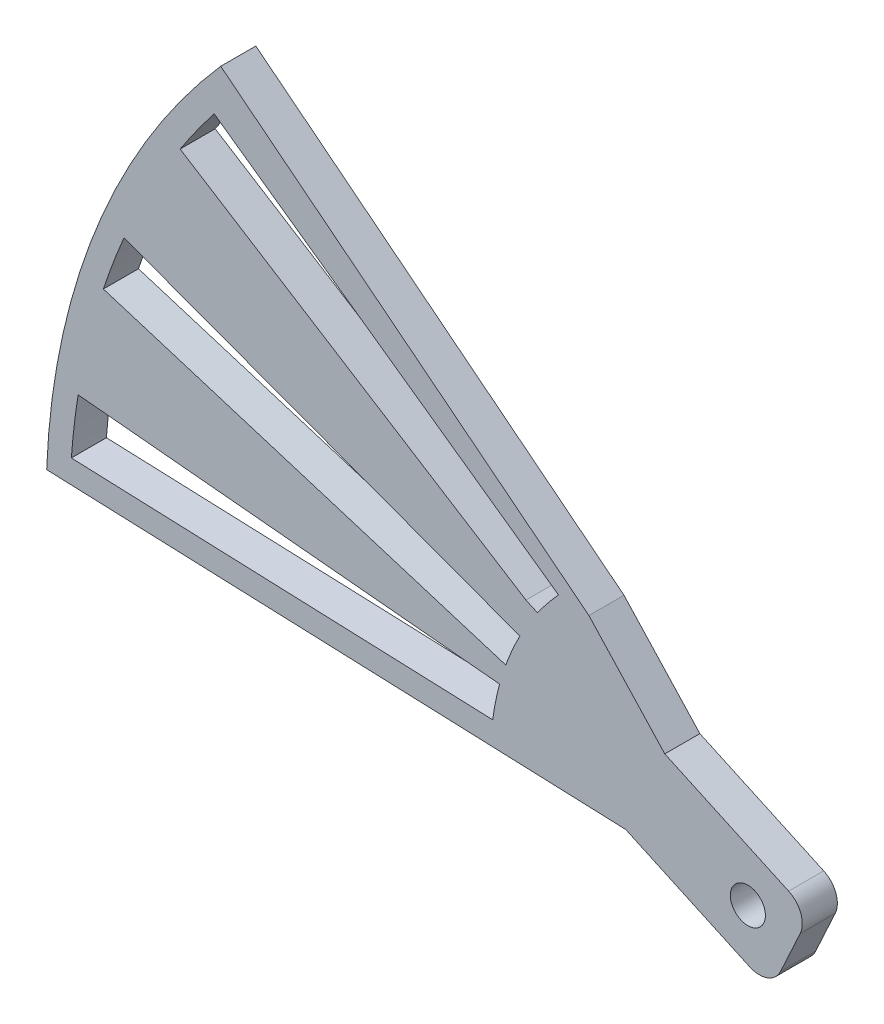
ISO-10303-21;
HEADER;
FILE_DESCRIPTION(('STEP AP214'),'2;1');
FILE_NAME('part.step','',(''),(''),'','','');
FILE_SCHEMA(('AUTOMOTIVE_DESIGN { 1 0 10303 214 1 1 1 1 }'));
ENDSEC;
DATA;
#1=APPLICATION_CONTEXT('core data for automotive mechanical design processes');
#2=APPLICATION_PROTOCOL_DEFINITION('international standard','automotive_design',2000,#1);
#3=PRODUCT_CONTEXT('',#1,'mechanical');
#4=PRODUCT('Part','Part','',(#3));
#5=PRODUCT_RELATED_PRODUCT_CATEGORY('part','',(#4));
#6=PRODUCT_DEFINITION_FORMATION('','',#4);
#7=PRODUCT_DEFINITION_CONTEXT('part definition',#1,'design');
#8=PRODUCT_DEFINITION('design','',#6,#7);
#9=PRODUCT_DEFINITION_SHAPE('','',#8);
#10=(LENGTH_UNIT() NAMED_UNIT(*) SI_UNIT(.MILLI.,.METRE.));
#11=(NAMED_UNIT(*) PLANE_ANGLE_UNIT() SI_UNIT($,.RADIAN.));
#12=(NAMED_UNIT(*) SI_UNIT($,.STERADIAN.) SOLID_ANGLE_UNIT());
#13=UNCERTAINTY_MEASURE_WITH_UNIT(LENGTH_MEASURE(1.E-05),#10,'distance_accuracy_value','');
#14=(GEOMETRIC_REPRESENTATION_CONTEXT(3) GLOBAL_UNCERTAINTY_ASSIGNED_CONTEXT((#13)) GLOBAL_UNIT_ASSIGNED_CONTEXT((#10,
#11,#12)) REPRESENTATION_CONTEXT('',''));
#15=CARTESIAN_POINT('',(0.,0.,0.));
#16=DIRECTION('',(0.,0.,1.));
#17=DIRECTION('',(1.,0.,0.));
#18=AXIS2_PLACEMENT_3D('',#15,#16,#17);
#19=CARTESIAN_POINT('',(0.,0.,3.));
#20=DIRECTION('',(0.,0.,1.));
#21=DIRECTION('',(1.,0.,0.));
#22=AXIS2_PLACEMENT_3D('',#19,#20,#21);
#23=PLANE('',#22);
#24=CARTESIAN_POINT('',(0.,0.,3.));
#25=DIRECTION('',(0.,0.,1.));
#26=DIRECTION('',(1.,0.,0.));
#27=AXIS2_PLACEMENT_3D('',#24,#25,#26);
#28=CIRCLE('',#27,58.);
#29=CARTESIAN_POINT('',(-53.3438743652165,22.7690813979834,3.));
#30=VERTEX_POINT('',#29);
#31=CARTESIAN_POINT('',(-55.1066860216154,18.0901397373016,3.));
#32=VERTEX_POINT('',#31);
#33=EDGE_CURVE('E534',#30,#32,#28,.T.);
#34=ORIENTED_EDGE('',*,*,#33,.F.);
#35=DIRECTION('',(-0.93742036755198,0.348199733628144,0.));
#36=VECTOR('',#35,1.);
#37=CARTESIAN_POINT('',(0.964470715017603,2.59653987309038,3.));
#38=LINE('',#37,#36);
#39=CARTESIAN_POINT('',(-19.494667641963,10.1959763401746,3.));
#40=VERTEX_POINT('',#39);
#41=EDGE_CURVE('E531',#40,#30,#38,.T.);
#42=ORIENTED_EDGE('',*,*,#41,.F.);
#43=CARTESIAN_POINT('',(0.,0.,3.));
#44=DIRECTION('',(0.,0.,1.));
#45=DIRECTION('',(1.,0.,0.));
#46=AXIS2_PLACEMENT_3D('',#43,#44,#45);
#47=CIRCLE('',#46,22.);
#48=CARTESIAN_POINT('',(-20.700540486008,7.44900151611905,3.));
#49=VERTEX_POINT('',#48);
#50=EDGE_CURVE('E528',#40,#49,#47,.T.);
#51=ORIENTED_EDGE('',*,*,#50,.T.);
#52=DIRECTION('',(-0.955351615946227,0.295471301328797,0.));
#53=VECTOR('',#52,1.);
#54=CARTESIAN_POINT('',(0.295471301328797,0.955351615946228,3.));
#55=LINE('',#54,#53);
#56=EDGE_CURVE('E536',#49,#32,#55,.T.);
#57=ORIENTED_EDGE('',*,*,#56,.T.);
#58=EDGE_LOOP('',(#34,#42,#51,#57));
#59=FACE_BOUND('',#58,.T.);
#60=DIRECTION('',(0.417641912046597,0.908611706562304,0.));
#61=VECTOR('',#60,1.);
#62=CARTESIAN_POINT('',(3.63444682624922,-1.67056764818639,3.));
#63=LINE('',#62,#61);
#64=CARTESIAN_POINT('',(2.79916300215601,-3.48779106131101,3.));
#65=VERTEX_POINT('',#64);
#66=CARTESIAN_POINT('',(4.4697306503424,0.146655764938201,3.));
#67=VERTEX_POINT('',#66);
#68=EDGE_CURVE('E426',#65,#67,#63,.T.);
#69=ORIENTED_EDGE('',*,*,#68,.T.);
#70=CARTESIAN_POINT('',(2.65250723721779,0.981939589031395,3.));
#71=DIRECTION('',(0.,0.,1.));
#72=DIRECTION('',(1.,0.,0.));
#73=AXIS2_PLACEMENT_3D('',#70,#71,#72);
#74=CIRCLE('',#73,2.);
#75=CARTESIAN_POINT('',(3.48779106131099,2.799163002156,3.));
#76=VERTEX_POINT('',#75);
#77=EDGE_CURVE('E257',#67,#76,#74,.T.);
#78=ORIENTED_EDGE('',*,*,#77,.T.);
#79=DIRECTION('',(0.908611706562304,-0.417641912046598,0.));
#80=VECTOR('',#79,1.);
#81=CARTESIAN_POINT('',(1.67056764818638,3.6344468262492,3.));
#82=LINE('',#81,#80);
#83=CARTESIAN_POINT('',(-7.1037631714681,7.6675538993624,3.));
#84=VERTEX_POINT('',#83);
#85=EDGE_CURVE('E429',#84,#76,#82,.T.);
#86=ORIENTED_EDGE('',*,*,#85,.F.);
#87=DIRECTION('',(-0.679623118291548,0.733561461013099,0.));
#88=VECTOR('',#87,1.);
#89=CARTESIAN_POINT('',(0.,0.,3.));
#90=LINE('',#89,#88);
#91=CARTESIAN_POINT('',(-13.592462365831,14.671229220262,3.));
#92=VERTEX_POINT('',#91);
#93=EDGE_CURVE('E427',#84,#92,#90,.T.);
#94=ORIENTED_EDGE('',*,*,#93,.T.);
#95=DIRECTION('',(-0.783940113940182,0.620836450086055,0.));
#96=VECTOR('',#95,1.);
#97=CARTESIAN_POINT('',(-13.592462365831,14.671229220262,3.));
#98=LINE('',#97,#96);
#99=CARTESIAN_POINT('',(-45.0736727010104,39.6025760430074,3.));
#100=VERTEX_POINT('',#99);
#101=EDGE_CURVE('E559',#92,#100,#98,.T.);
#102=ORIENTED_EDGE('',*,*,#101,.T.);
#103=CARTESIAN_POINT('',(0.,0.,3.));
#104=DIRECTION('',(0.,0.,1.));
#105=DIRECTION('',(1.,0.,0.));
#106=AXIS2_PLACEMENT_3D('',#103,#104,#105);
#107=CIRCLE('',#106,60.);
#108=CARTESIAN_POINT('',(-59.9563439456744,2.28841007426227,3.));
#109=VERTEX_POINT('',#108);
#110=EDGE_CURVE('E411',#100,#109,#107,.T.);
#111=ORIENTED_EDGE('',*,*,#110,.T.);
#112=DIRECTION('',(-0.999272399094574,0.0381401679043713,0.));
#113=VECTOR('',#112,1.);
#114=CARTESIAN_POINT('',(-19.9854479818915,0.762803358087425,3.));
#115=LINE('',#114,#113);
#116=CARTESIAN_POINT('',(-10.4448984678413,0.39866024686416,3.));
#117=VERTEX_POINT('',#116);
#118=EDGE_CURVE('E405',#117,#109,#115,.T.);
#119=ORIENTED_EDGE('',*,*,#118,.F.);
#120=DIRECTION('',(0.908611706562304,-0.417641912046597,0.));
#121=VECTOR('',#120,1.);
#122=CARTESIAN_POINT('',(-1.67056764818639,-3.63444682624923,3.));
#123=LINE('',#122,#121);
#124=CARTESIAN_POINT('',(0.146655764938214,-4.46973065034243,3.));
#125=VERTEX_POINT('',#124);
#126=EDGE_CURVE('E408',#117,#125,#123,.T.);
#127=ORIENTED_EDGE('',*,*,#126,.T.);
#128=CARTESIAN_POINT('',(0.981939589031406,-2.65250723721782,3.));
#129=DIRECTION('',(0.,0.,1.));
#130=DIRECTION('',(1.,0.,0.));
#131=AXIS2_PLACEMENT_3D('',#128,#129,#130);
#132=CIRCLE('',#131,2.);
#133=EDGE_CURVE('E584',#125,#65,#132,.T.);
#134=ORIENTED_EDGE('',*,*,#133,.T.);
#135=EDGE_LOOP('',(#69,#78,#86,#94,#102,#111,#119,#127,#134));
#136=FACE_BOUND('',#135,.T.);
#137=CARTESIAN_POINT('',(0.,0.,3.));
#138=DIRECTION('',(0.,0.,1.));
#139=DIRECTION('',(1.,0.,0.));
#140=AXIS2_PLACEMENT_3D('',#137,#138,#139);
#141=CIRCLE('',#140,22.);
#142=CARTESIAN_POINT('',(-16.3569194216375,14.7122801439497,3.));
#143=VERTEX_POINT('',#142);
#144=CARTESIAN_POINT('',(-17.985708936797,12.6694227982502,3.));
#145=VERTEX_POINT('',#144);
#146=EDGE_CURVE('E501',#143,#145,#141,.T.);
#147=ORIENTED_EDGE('',*,*,#146,.T.);
#148=DIRECTION('',(0.908611706562304,-0.417641912046596,0.));
#149=VECTOR('',#148,1.);
#150=CARTESIAN_POINT('',(1.67056764818638,3.63444682624921,3.));
#151=LINE('',#150,#149);
#152=CARTESIAN_POINT('',(-18.9746521151823,13.1239889423393,3.));
#153=VERTEX_POINT('',#152);
#154=EDGE_CURVE('E496',#153,#145,#151,.T.);
#155=ORIENTED_EDGE('',*,*,#154,.F.);
#156=DIRECTION('',(-0.846325198964337,0.532666553857078,0.));
#157=VECTOR('',#156,1.);
#158=CARTESIAN_POINT('',(0.532666553857077,0.846325198964337,3.));
#159=LINE('',#158,#157);
#160=CARTESIAN_POINT('',(-48.5468985369015,31.7363930283167,3.));
#161=VERTEX_POINT('',#160);
#162=EDGE_CURVE('E517',#153,#161,#159,.T.);
#163=ORIENTED_EDGE('',*,*,#162,.T.);
#164=CARTESIAN_POINT('',(0.,0.,3.));
#165=DIRECTION('',(0.,0.,1.));
#166=DIRECTION('',(1.,0.,0.));
#167=AXIS2_PLACEMENT_3D('',#164,#165,#166);
#168=CIRCLE('',#167,58.);
#169=CARTESIAN_POINT('',(-45.6331540183943,35.7996543884644,3.));
#170=VERTEX_POINT('',#169);
#171=EDGE_CURVE('E520',#170,#161,#168,.T.);
#172=ORIENTED_EDGE('',*,*,#171,.F.);
#173=DIRECTION('',(-0.81535782054526,0.578957359807856,0.));
#174=VECTOR('',#173,1.);
#175=CARTESIAN_POINT('',(1.60364114285886,2.25844153291714,3.));
#176=LINE('',#175,#174);
#177=CARTESIAN_POINT('',(-16.191490090042,14.8941481348908,3.));
#178=VERTEX_POINT('',#177);
#179=EDGE_CURVE('E522',#178,#170,#176,.T.);
#180=ORIENTED_EDGE('',*,*,#179,.F.);
#181=DIRECTION('',(0.672883873931036,0.739748127543126,0.));
#182=VECTOR('',#181,1.);
#183=CARTESIAN_POINT('',(-16.2742047558396,14.8032141394205,3.));
#184=LINE('',#183,#182);
#185=EDGE_CURVE('E524',#143,#178,#184,.T.);
#186=ORIENTED_EDGE('',*,*,#185,.F.);
#187=EDGE_LOOP('',(#147,#155,#163,#172,#180,#186));
#188=FACE_BOUND('',#187,.T.);
#189=CARTESIAN_POINT('',(0.,0.,3.));
#190=DIRECTION('',(0.,0.,1.));
#191=DIRECTION('',(1.,0.,0.));
#192=AXIS2_PLACEMENT_3D('',#189,#190,#191);
#193=CIRCLE('',#192,58.);
#194=CARTESIAN_POINT('',(-57.2695634611574,9.17589782901159,3.));
#195=VERTEX_POINT('',#194);
#196=CARTESIAN_POINT('',(-57.8470508935835,4.20935896724981,3.));
#197=VERTEX_POINT('',#196);
#198=EDGE_CURVE('E478',#195,#197,#193,.T.);
#199=ORIENTED_EDGE('',*,*,#198,.F.);
#200=DIRECTION('',(-0.995579779225785,0.0939196635254627,0.));
#201=VECTOR('',#200,1.);
#202=CARTESIAN_POINT('',(-21.228263800293,5.77588227244706,3.));
#203=LINE('',#202,#201);
#204=CARTESIAN_POINT('',(-21.228263800293,5.77588227244706,3.));
#205=VERTEX_POINT('',#204);
#206=EDGE_CURVE('E455',#205,#195,#203,.T.);
#207=ORIENTED_EDGE('',*,*,#206,.F.);
#208=CARTESIAN_POINT('',(0.,0.,3.));
#209=DIRECTION('',(0.,0.,1.));
#210=DIRECTION('',(1.,0.,0.));
#211=AXIS2_PLACEMENT_3D('',#208,#209,#210);
#212=CIRCLE('',#211,22.);
#213=CARTESIAN_POINT('',(-21.8166810272474,2.8341540105195,3.));
#214=VERTEX_POINT('',#213);
#215=EDGE_CURVE('E461',#205,#214,#212,.T.);
#216=ORIENTED_EDGE('',*,*,#215,.T.);
#217=DIRECTION('',(-0.999272399094574,0.0381401679043713,0.));
#218=VECTOR('',#217,1.);
#219=CARTESIAN_POINT('',(0.0762803358087425,1.99854479818915,3.));
#220=LINE('',#219,#218);
#221=EDGE_CURVE('E474',#214,#197,#220,.T.);
#222=ORIENTED_EDGE('',*,*,#221,.T.);
#223=EDGE_LOOP('',(#199,#207,#216,#222));
#224=FACE_BOUND('',#223,.T.);
#225=CARTESIAN_POINT('',(0.,0.,3.));
#226=DIRECTION('',(0.,0.,1.));
#227=DIRECTION('',(1.,0.,0.));
#228=AXIS2_PLACEMENT_3D('',#225,#226,#227);
#229=CIRCLE('',#228,1.5);
#230=CARTESIAN_POINT('',(1.5,0.,3.));
#231=VERTEX_POINT('',#230);
#232=EDGE_CURVE('E432',#231,#231,#229,.T.);
#233=ORIENTED_EDGE('',*,*,#232,.F.);
#234=EDGE_LOOP('',(#233));
#235=FACE_BOUND('',#234,.T.);
#236=ADVANCED_FACE('F249',(#59,#136,#188,#224,#235),#23,.T.);
#237=CARTESIAN_POINT('',(0.,0.,0.));
#238=DIRECTION('',(0.,0.,1.));
#239=DIRECTION('',(1.,0.,0.));
#240=AXIS2_PLACEMENT_3D('',#237,#238,#239);
#241=PLANE('',#240);
#242=DIRECTION('',(-0.93742036755198,0.348199733628144,0.));
#243=VECTOR('',#242,1.);
#244=CARTESIAN_POINT('',(0.964470715017603,2.59653987309038,0.));
#245=LINE('',#244,#243);
#246=CARTESIAN_POINT('',(-19.494667641963,10.1959763401746,0.));
#247=VERTEX_POINT('',#246);
#248=CARTESIAN_POINT('',(-53.3438743652165,22.7690813979834,0.));
#249=VERTEX_POINT('',#248);
#250=EDGE_CURVE('E542',#247,#249,#245,.T.);
#251=ORIENTED_EDGE('',*,*,#250,.T.);
#252=CARTESIAN_POINT('',(0.,0.,0.));
#253=DIRECTION('',(0.,0.,1.));
#254=DIRECTION('',(1.,0.,0.));
#255=AXIS2_PLACEMENT_3D('',#252,#253,#254);
#256=CIRCLE('',#255,58.);
#257=CARTESIAN_POINT('',(-55.1066860216154,18.0901397373016,0.));
#258=VERTEX_POINT('',#257);
#259=EDGE_CURVE('E545',#249,#258,#256,.T.);
#260=ORIENTED_EDGE('',*,*,#259,.T.);
#261=DIRECTION('',(-0.955351615946227,0.295471301328797,0.));
#262=VECTOR('',#261,1.);
#263=CARTESIAN_POINT('',(0.295471301328797,0.955351615946228,0.));
#264=LINE('',#263,#262);
#265=CARTESIAN_POINT('',(-20.700540486008,7.44900151611905,0.));
#266=VERTEX_POINT('',#265);
#267=EDGE_CURVE('E532',#266,#258,#264,.T.);
#268=ORIENTED_EDGE('',*,*,#267,.F.);
#269=CARTESIAN_POINT('',(0.,0.,0.));
#270=DIRECTION('',(0.,0.,1.));
#271=DIRECTION('',(1.,0.,0.));
#272=AXIS2_PLACEMENT_3D('',#269,#270,#271);
#273=CIRCLE('',#272,22.);
#274=EDGE_CURVE('E515',#247,#266,#273,.T.);
#275=ORIENTED_EDGE('',*,*,#274,.F.);
#276=EDGE_LOOP('',(#251,#260,#268,#275));
#277=FACE_BOUND('',#276,.T.);
#278=DIRECTION('',(0.908611706562304,-0.417641912046598,0.));
#279=VECTOR('',#278,1.);
#280=CARTESIAN_POINT('',(1.67056764818638,3.6344468262492,0.));
#281=LINE('',#280,#279);
#282=CARTESIAN_POINT('',(-7.1037631714681,7.6675538993624,0.));
#283=VERTEX_POINT('',#282);
#284=CARTESIAN_POINT('',(3.48779106131099,2.799163002156,0.));
#285=VERTEX_POINT('',#284);
#286=EDGE_CURVE('E448',#283,#285,#281,.T.);
#287=ORIENTED_EDGE('',*,*,#286,.T.);
#288=CARTESIAN_POINT('',(2.65250723721779,0.981939589031395,0.));
#289=DIRECTION('',(0.,0.,1.));
#290=DIRECTION('',(1.,0.,0.));
#291=AXIS2_PLACEMENT_3D('',#288,#289,#290);
#292=CIRCLE('',#291,2.);
#293=CARTESIAN_POINT('',(4.4697306503424,0.146655764938201,0.));
#294=VERTEX_POINT('',#293);
#295=EDGE_CURVE('E578',#285,#294,#292,.F.);
#296=ORIENTED_EDGE('',*,*,#295,.T.);
#297=DIRECTION('',(0.417641912046597,0.908611706562304,0.));
#298=VECTOR('',#297,1.);
#299=CARTESIAN_POINT('',(3.63444682624922,-1.67056764818639,0.));
#300=LINE('',#299,#298);
#301=CARTESIAN_POINT('',(2.79916300215601,-3.48779106131101,0.));
#302=VERTEX_POINT('',#301);
#303=EDGE_CURVE('E446',#302,#294,#300,.T.);
#304=ORIENTED_EDGE('',*,*,#303,.F.);
#305=CARTESIAN_POINT('',(0.981939589031406,-2.65250723721782,0.));
#306=DIRECTION('',(0.,0.,1.));
#307=DIRECTION('',(1.,0.,0.));
#308=AXIS2_PLACEMENT_3D('',#305,#306,#307);
#309=CIRCLE('',#308,2.);
#310=CARTESIAN_POINT('',(0.146655764938214,-4.46973065034243,0.));
#311=VERTEX_POINT('',#310);
#312=EDGE_CURVE('E576',#302,#311,#309,.F.);
#313=ORIENTED_EDGE('',*,*,#312,.T.);
#314=DIRECTION('',(0.908611706562304,-0.417641912046597,0.));
#315=VECTOR('',#314,1.);
#316=CARTESIAN_POINT('',(-1.67056764818639,-3.63444682624923,0.));
#317=LINE('',#316,#315);
#318=CARTESIAN_POINT('',(-10.4448984678413,0.39866024686416,0.));
#319=VERTEX_POINT('',#318);
#320=EDGE_CURVE('E444',#319,#311,#317,.T.);
#321=ORIENTED_EDGE('',*,*,#320,.F.);
#322=DIRECTION('',(-0.999272399094574,0.0381401679043713,0.));
#323=VECTOR('',#322,1.);
#324=CARTESIAN_POINT('',(-19.9854479818915,0.762803358087425,0.));
#325=LINE('',#324,#323);
#326=CARTESIAN_POINT('',(-59.9563439456744,2.28841007426227,0.));
#327=VERTEX_POINT('',#326);
#328=EDGE_CURVE('E420',#319,#327,#325,.T.);
#329=ORIENTED_EDGE('',*,*,#328,.T.);
#330=CARTESIAN_POINT('',(0.,0.,0.));
#331=DIRECTION('',(0.,0.,1.));
#332=DIRECTION('',(1.,0.,0.));
#333=AXIS2_PLACEMENT_3D('',#330,#331,#332);
#334=CIRCLE('',#333,60.);
#335=CARTESIAN_POINT('',(-45.0736727010104,39.6025760430074,0.));
#336=VERTEX_POINT('',#335);
#337=EDGE_CURVE('E563',#336,#327,#334,.T.);
#338=ORIENTED_EDGE('',*,*,#337,.F.);
#339=DIRECTION('',(-0.783940113940182,0.620836450086055,0.));
#340=VECTOR('',#339,1.);
#341=CARTESIAN_POINT('',(-13.592462365831,14.671229220262,0.));
#342=LINE('',#341,#340);
#343=CARTESIAN_POINT('',(-13.592462365831,14.671229220262,0.));
#344=VERTEX_POINT('',#343);
#345=EDGE_CURVE('E414',#344,#336,#342,.T.);
#346=ORIENTED_EDGE('',*,*,#345,.F.);
#347=DIRECTION('',(-0.679623118291548,0.733561461013099,0.));
#348=VECTOR('',#347,1.);
#349=CARTESIAN_POINT('',(0.,0.,0.));
#350=LINE('',#349,#348);
#351=EDGE_CURVE('E441',#283,#344,#350,.T.);
#352=ORIENTED_EDGE('',*,*,#351,.F.);
#353=EDGE_LOOP('',(#287,#296,#304,#313,#321,#329,#338,#346,#352));
#354=FACE_BOUND('',#353,.T.);
#355=DIRECTION('',(0.908611706562304,-0.417641912046596,0.));
#356=VECTOR('',#355,1.);
#357=CARTESIAN_POINT('',(1.67056764818638,3.63444682624921,0.));
#358=LINE('',#357,#356);
#359=CARTESIAN_POINT('',(-18.9746521151823,13.1239889423393,0.));
#360=VERTEX_POINT('',#359);
#361=CARTESIAN_POINT('',(-17.985708936797,12.6694227982502,0.));
#362=VERTEX_POINT('',#361);
#363=EDGE_CURVE('E497',#360,#362,#358,.T.);
#364=ORIENTED_EDGE('',*,*,#363,.T.);
#365=CARTESIAN_POINT('',(0.,0.,0.));
#366=DIRECTION('',(0.,0.,1.));
#367=DIRECTION('',(1.,0.,0.));
#368=AXIS2_PLACEMENT_3D('',#365,#366,#367);
#369=CIRCLE('',#368,22.);
#370=CARTESIAN_POINT('',(-16.3569194216375,14.7122801439497,0.));
#371=VERTEX_POINT('',#370);
#372=EDGE_CURVE('E513',#371,#362,#369,.T.);
#373=ORIENTED_EDGE('',*,*,#372,.F.);
#374=DIRECTION('',(0.672883873931036,0.739748127543126,0.));
#375=VECTOR('',#374,1.);
#376=CARTESIAN_POINT('',(-16.2742047558396,14.8032141394205,0.));
#377=LINE('',#376,#375);
#378=CARTESIAN_POINT('',(-16.191490090042,14.8941481348908,0.));
#379=VERTEX_POINT('',#378);
#380=EDGE_CURVE('E510',#371,#379,#377,.T.);
#381=ORIENTED_EDGE('',*,*,#380,.T.);
#382=DIRECTION('',(-0.81535782054526,0.578957359807856,0.));
#383=VECTOR('',#382,1.);
#384=CARTESIAN_POINT('',(1.60364114285886,2.25844153291714,0.));
#385=LINE('',#384,#383);
#386=CARTESIAN_POINT('',(-45.6331540183943,35.7996543884644,0.));
#387=VERTEX_POINT('',#386);
#388=EDGE_CURVE('E507',#379,#387,#385,.T.);
#389=ORIENTED_EDGE('',*,*,#388,.T.);
#390=CARTESIAN_POINT('',(0.,0.,0.));
#391=DIRECTION('',(0.,0.,1.));
#392=DIRECTION('',(1.,0.,0.));
#393=AXIS2_PLACEMENT_3D('',#390,#391,#392);
#394=CIRCLE('',#393,58.);
#395=CARTESIAN_POINT('',(-48.5468985369015,31.7363930283167,0.));
#396=VERTEX_POINT('',#395);
#397=EDGE_CURVE('E504',#387,#396,#394,.T.);
#398=ORIENTED_EDGE('',*,*,#397,.T.);
#399=DIRECTION('',(-0.846325198964337,0.532666553857078,0.));
#400=VECTOR('',#399,1.);
#401=CARTESIAN_POINT('',(0.532666553857077,0.846325198964337,0.));
#402=LINE('',#401,#400);
#403=EDGE_CURVE('E500',#360,#396,#402,.T.);
#404=ORIENTED_EDGE('',*,*,#403,.F.);
#405=EDGE_LOOP('',(#364,#373,#381,#389,#398,#404));
#406=FACE_BOUND('',#405,.T.);
#407=DIRECTION('',(-0.995579779225785,0.0939196635254627,0.));
#408=VECTOR('',#407,1.);
#409=CARTESIAN_POINT('',(-21.228263800293,5.77588227244706,0.));
#410=LINE('',#409,#408);
#411=CARTESIAN_POINT('',(-21.228263800293,5.77588227244706,0.));
#412=VERTEX_POINT('',#411);
#413=CARTESIAN_POINT('',(-57.2695634611574,9.17589782901159,0.));
#414=VERTEX_POINT('',#413);
#415=EDGE_CURVE('E457',#412,#414,#410,.T.);
#416=ORIENTED_EDGE('',*,*,#415,.T.);
#417=CARTESIAN_POINT('',(0.,0.,0.));
#418=DIRECTION('',(0.,0.,1.));
#419=DIRECTION('',(1.,0.,0.));
#420=AXIS2_PLACEMENT_3D('',#417,#418,#419);
#421=CIRCLE('',#420,58.);
#422=CARTESIAN_POINT('',(-57.8470508935835,4.20935896724981,0.));
#423=VERTEX_POINT('',#422);
#424=EDGE_CURVE('E456',#414,#423,#421,.T.);
#425=ORIENTED_EDGE('',*,*,#424,.T.);
#426=DIRECTION('',(-0.999272399094574,0.0381401679043713,0.));
#427=VECTOR('',#426,1.);
#428=CARTESIAN_POINT('',(0.0762803358087425,1.99854479818915,0.));
#429=LINE('',#428,#427);
#430=CARTESIAN_POINT('',(-21.8166810272474,2.8341540105195,0.));
#431=VERTEX_POINT('',#430);
#432=EDGE_CURVE('E475',#431,#423,#429,.T.);
#433=ORIENTED_EDGE('',*,*,#432,.F.);
#434=CARTESIAN_POINT('',(0.,0.,0.));
#435=DIRECTION('',(0.,0.,1.));
#436=DIRECTION('',(1.,0.,0.));
#437=AXIS2_PLACEMENT_3D('',#434,#435,#436);
#438=CIRCLE('',#437,22.);
#439=EDGE_CURVE('E460',#412,#431,#438,.T.);
#440=ORIENTED_EDGE('',*,*,#439,.F.);
#441=EDGE_LOOP('',(#416,#425,#433,#440));
#442=FACE_BOUND('',#441,.T.);
#443=CARTESIAN_POINT('',(0.,0.,0.));
#444=DIRECTION('',(0.,0.,1.));
#445=DIRECTION('',(1.,0.,0.));
#446=AXIS2_PLACEMENT_3D('',#443,#444,#445);
#447=CIRCLE('',#446,1.5);
#448=CARTESIAN_POINT('',(1.5,0.,0.));
#449=VERTEX_POINT('',#448);
#450=EDGE_CURVE('E438',#449,#449,#447,.T.);
#451=ORIENTED_EDGE('',*,*,#450,.T.);
#452=EDGE_LOOP('',(#451));
#453=FACE_BOUND('',#452,.T.);
#454=ADVANCED_FACE('F596',(#277,#354,#406,#442,#453),#241,.F.);
#455=CARTESIAN_POINT('',(-13.592462365831,14.671229220262,3.));
#456=DIRECTION('',(-0.620836450086055,-0.783940113940182,0.));
#457=DIRECTION('',(0.783940113940182,-0.620836450086055,0.));
#458=AXIS2_PLACEMENT_3D('',#455,#456,#457);
#459=PLANE('',#458);
#460=ORIENTED_EDGE('',*,*,#345,.T.);
#461=DIRECTION('',(0.,0.,-1.));
#462=VECTOR('',#461,1.);
#463=CARTESIAN_POINT('',(-45.0736727010104,39.6025760430074,3.));
#464=LINE('',#463,#462);
#465=EDGE_CURVE('E570',#100,#336,#464,.T.);
#466=ORIENTED_EDGE('',*,*,#465,.F.);
#467=ORIENTED_EDGE('',*,*,#101,.F.);
#468=DIRECTION('',(0.,0.,-1.));
#469=VECTOR('',#468,1.);
#470=CARTESIAN_POINT('',(-13.592462365831,14.671229220262,3.));
#471=LINE('',#470,#469);
#472=EDGE_CURVE('E567',#92,#344,#471,.T.);
#473=ORIENTED_EDGE('',*,*,#472,.T.);
#474=EDGE_LOOP('',(#460,#466,#467,#473));
#475=FACE_BOUND('',#474,.T.);
#476=ADVANCED_FACE('F608',(#475),#459,.F.);
#477=CARTESIAN_POINT('',(0.,0.,3.));
#478=DIRECTION('',(0.,0.,-1.));
#479=DIRECTION('',(-1.,0.,0.));
#480=AXIS2_PLACEMENT_3D('',#477,#478,#479);
#481=CYLINDRICAL_SURFACE('',#480,60.);
#482=ORIENTED_EDGE('',*,*,#337,.T.);
#483=DIRECTION('',(0.,0.,-1.));
#484=VECTOR('',#483,1.);
#485=CARTESIAN_POINT('',(-59.9563439456744,2.28841007426227,3.));
#486=LINE('',#485,#484);
#487=EDGE_CURVE('E561',#109,#327,#486,.T.);
#488=ORIENTED_EDGE('',*,*,#487,.F.);
#489=ORIENTED_EDGE('',*,*,#110,.F.);
#490=ORIENTED_EDGE('',*,*,#465,.T.);
#491=EDGE_LOOP('',(#482,#488,#489,#490));
#492=FACE_BOUND('',#491,.T.);
#493=ADVANCED_FACE('F605',(#492),#481,.T.);
#494=CARTESIAN_POINT('',(-19.9854479818915,0.762803358087425,3.));
#495=DIRECTION('',(-0.0381401679043713,-0.999272399094574,0.));
#496=DIRECTION('',(0.999272399094575,-0.0381401679043713,0.));
#497=AXIS2_PLACEMENT_3D('',#494,#495,#496);
#498=PLANE('',#497);
#499=ORIENTED_EDGE('',*,*,#328,.F.);
#500=DIRECTION('',(0.,0.,-1.));
#501=VECTOR('',#500,1.);
#502=CARTESIAN_POINT('',(-10.4448984678413,0.39866024686416,3.));
#503=LINE('',#502,#501);
#504=EDGE_CURVE('E417',#117,#319,#503,.T.);
#505=ORIENTED_EDGE('',*,*,#504,.F.);
#506=ORIENTED_EDGE('',*,*,#118,.T.);
#507=ORIENTED_EDGE('',*,*,#487,.T.);
#508=EDGE_LOOP('',(#499,#505,#506,#507));
#509=FACE_BOUND('',#508,.T.);
#510=ADVANCED_FACE('F418',(#509),#498,.T.);
#511=CARTESIAN_POINT('',(0.964470715017603,2.59653987309038,3.));
#512=DIRECTION('',(-0.348199733628144,-0.93742036755198,0.));
#513=DIRECTION('',(0.93742036755198,-0.348199733628144,0.));
#514=AXIS2_PLACEMENT_3D('',#511,#512,#513);
#515=PLANE('',#514);
#516=ORIENTED_EDGE('',*,*,#250,.F.);
#517=DIRECTION('',(0.,0.,-1.));
#518=VECTOR('',#517,1.);
#519=CARTESIAN_POINT('',(-19.494667641963,10.1959763401746,3.));
#520=LINE('',#519,#518);
#521=EDGE_CURVE('E555',#40,#247,#520,.T.);
#522=ORIENTED_EDGE('',*,*,#521,.F.);
#523=ORIENTED_EDGE('',*,*,#41,.T.);
#524=DIRECTION('',(0.,0.,-1.));
#525=VECTOR('',#524,1.);
#526=CARTESIAN_POINT('',(-53.3438743652165,22.7690813979834,3.));
#527=LINE('',#526,#525);
#528=EDGE_CURVE('E553',#30,#249,#527,.T.);
#529=ORIENTED_EDGE('',*,*,#528,.T.);
#530=EDGE_LOOP('',(#516,#522,#523,#529));
#531=FACE_BOUND('',#530,.T.);
#532=ADVANCED_FACE('F642',(#531),#515,.T.);
#533=CARTESIAN_POINT('',(0.,0.,3.));
#534=DIRECTION('',(0.,0.,-1.));
#535=DIRECTION('',(-1.,0.,0.));
#536=AXIS2_PLACEMENT_3D('',#533,#534,#535);
#537=CYLINDRICAL_SURFACE('',#536,58.);
#538=ORIENTED_EDGE('',*,*,#259,.F.);
#539=ORIENTED_EDGE('',*,*,#528,.F.);
#540=ORIENTED_EDGE('',*,*,#33,.T.);
#541=DIRECTION('',(0.,0.,-1.));
#542=VECTOR('',#541,1.);
#543=CARTESIAN_POINT('',(-55.1066860216154,18.0901397373016,3.));
#544=LINE('',#543,#542);
#545=EDGE_CURVE('E551',#32,#258,#544,.T.);
#546=ORIENTED_EDGE('',*,*,#545,.T.);
#547=EDGE_LOOP('',(#538,#539,#540,#546));
#548=FACE_BOUND('',#547,.T.);
#549=ADVANCED_FACE('F822',(#548),#537,.F.);
#550=CARTESIAN_POINT('',(0.295471301328797,0.955351615946228,3.));
#551=DIRECTION('',(-0.295471301328797,-0.955351615946227,0.));
#552=DIRECTION('',(0.955351615946227,-0.295471301328797,0.));
#553=AXIS2_PLACEMENT_3D('',#550,#551,#552);
#554=PLANE('',#553);
#555=ORIENTED_EDGE('',*,*,#267,.T.);
#556=ORIENTED_EDGE('',*,*,#545,.F.);
#557=ORIENTED_EDGE('',*,*,#56,.F.);
#558=DIRECTION('',(0.,0.,-1.));
#559=VECTOR('',#558,1.);
#560=CARTESIAN_POINT('',(-20.700540486008,7.44900151611905,3.));
#561=LINE('',#560,#559);
#562=EDGE_CURVE('E539',#49,#266,#561,.T.);
#563=ORIENTED_EDGE('',*,*,#562,.T.);
#564=EDGE_LOOP('',(#555,#556,#557,#563));
#565=FACE_BOUND('',#564,.T.);
#566=ADVANCED_FACE('F812',(#565),#554,.F.);
#567=CARTESIAN_POINT('',(0.,0.,3.));
#568=DIRECTION('',(0.,0.,-1.));
#569=DIRECTION('',(-1.,0.,0.));
#570=AXIS2_PLACEMENT_3D('',#567,#568,#569);
#571=CYLINDRICAL_SURFACE('',#570,22.);
#572=ORIENTED_EDGE('',*,*,#274,.T.);
#573=ORIENTED_EDGE('',*,*,#562,.F.);
#574=ORIENTED_EDGE('',*,*,#50,.F.);
#575=ORIENTED_EDGE('',*,*,#521,.T.);
#576=EDGE_LOOP('',(#572,#573,#574,#575));
#577=FACE_BOUND('',#576,.T.);
#578=ADVANCED_FACE('F634',(#577),#571,.T.);
#579=CARTESIAN_POINT('',(0.,0.,3.));
#580=DIRECTION('',(0.,0.,-1.));
#581=DIRECTION('',(-1.,0.,0.));
#582=AXIS2_PLACEMENT_3D('',#579,#580,#581);
#583=CYLINDRICAL_SURFACE('',#582,22.);
#584=ORIENTED_EDGE('',*,*,#372,.T.);
#585=DIRECTION('',(0.,0.,-1.));
#586=VECTOR('',#585,1.);
#587=CARTESIAN_POINT('',(-17.985708936797,12.6694227982502,3.));
#588=LINE('',#587,#586);
#589=EDGE_CURVE('E493',#145,#362,#588,.T.);
#590=ORIENTED_EDGE('',*,*,#589,.F.);
#591=ORIENTED_EDGE('',*,*,#146,.F.);
#592=DIRECTION('',(0.,0.,-1.));
#593=VECTOR('',#592,1.);
#594=CARTESIAN_POINT('',(-16.3569194216375,14.7122801439497,3.));
#595=LINE('',#594,#593);
#596=EDGE_CURVE('E463',#143,#371,#595,.T.);
#597=ORIENTED_EDGE('',*,*,#596,.T.);
#598=EDGE_LOOP('',(#584,#590,#591,#597));
#599=FACE_BOUND('',#598,.T.);
#600=ADVANCED_FACE('F793',(#599),#583,.T.);
#601=CARTESIAN_POINT('',(-16.2742047558396,14.8032141394205,3.));
#602=DIRECTION('',(-0.739748127543126,0.672883873931036,0.));
#603=DIRECTION('',(-0.672883873931036,-0.739748127543126,0.));
#604=AXIS2_PLACEMENT_3D('',#601,#602,#603);
#605=PLANE('',#604);
#606=ORIENTED_EDGE('',*,*,#380,.F.);
#607=ORIENTED_EDGE('',*,*,#596,.F.);
#608=ORIENTED_EDGE('',*,*,#185,.T.);
#609=DIRECTION('',(0.,0.,-1.));
#610=VECTOR('',#609,1.);
#611=CARTESIAN_POINT('',(-16.191490090042,14.8941481348908,3.));
#612=LINE('',#611,#610);
#613=EDGE_CURVE('E485',#178,#379,#612,.T.);
#614=ORIENTED_EDGE('',*,*,#613,.T.);
#615=EDGE_LOOP('',(#606,#607,#608,#614));
#616=FACE_BOUND('',#615,.T.);
#617=ADVANCED_FACE('F783',(#616),#605,.T.);
#618=CARTESIAN_POINT('',(1.60364114285886,2.25844153291714,3.));
#619=DIRECTION('',(-0.578957359807856,-0.81535782054526,0.));
#620=DIRECTION('',(0.81535782054526,-0.578957359807856,0.));
#621=AXIS2_PLACEMENT_3D('',#618,#619,#620);
#622=PLANE('',#621);
#623=ORIENTED_EDGE('',*,*,#388,.F.);
#624=ORIENTED_EDGE('',*,*,#613,.F.);
#625=ORIENTED_EDGE('',*,*,#179,.T.);
#626=DIRECTION('',(0.,0.,-1.));
#627=VECTOR('',#626,1.);
#628=CARTESIAN_POINT('',(-45.6331540183943,35.7996543884644,3.));
#629=LINE('',#628,#627);
#630=EDGE_CURVE('E487',#170,#387,#629,.T.);
#631=ORIENTED_EDGE('',*,*,#630,.T.);
#632=EDGE_LOOP('',(#623,#624,#625,#631));
#633=FACE_BOUND('',#632,.T.);
#634=ADVANCED_FACE('F773',(#633),#622,.T.);
#635=CARTESIAN_POINT('',(0.,0.,3.));
#636=DIRECTION('',(0.,0.,-1.));
#637=DIRECTION('',(-1.,0.,0.));
#638=AXIS2_PLACEMENT_3D('',#635,#636,#637);
#639=CYLINDRICAL_SURFACE('',#638,58.);
#640=ORIENTED_EDGE('',*,*,#397,.F.);
#641=ORIENTED_EDGE('',*,*,#630,.F.);
#642=ORIENTED_EDGE('',*,*,#171,.T.);
#643=DIRECTION('',(0.,0.,-1.));
#644=VECTOR('',#643,1.);
#645=CARTESIAN_POINT('',(-48.5468985369015,31.7363930283167,3.));
#646=LINE('',#645,#644);
#647=EDGE_CURVE('E489',#161,#396,#646,.T.);
#648=ORIENTED_EDGE('',*,*,#647,.T.);
#649=EDGE_LOOP('',(#640,#641,#642,#648));
#650=FACE_BOUND('',#649,.T.);
#651=ADVANCED_FACE('F763',(#650),#639,.F.);
#652=CARTESIAN_POINT('',(0.532666553857077,0.846325198964337,3.));
#653=DIRECTION('',(-0.532666553857078,-0.846325198964337,0.));
#654=DIRECTION('',(0.846325198964337,-0.532666553857078,0.));
#655=AXIS2_PLACEMENT_3D('',#652,#653,#654);
#656=PLANE('',#655);
#657=ORIENTED_EDGE('',*,*,#403,.T.);
#658=ORIENTED_EDGE('',*,*,#647,.F.);
#659=ORIENTED_EDGE('',*,*,#162,.F.);
#660=DIRECTION('',(0.,0.,-1.));
#661=VECTOR('',#660,1.);
#662=CARTESIAN_POINT('',(-18.9746521151823,13.1239889423393,3.));
#663=LINE('',#662,#661);
#664=EDGE_CURVE('E491',#153,#360,#663,.T.);
#665=ORIENTED_EDGE('',*,*,#664,.T.);
#666=EDGE_LOOP('',(#657,#658,#659,#665));
#667=FACE_BOUND('',#666,.T.);
#668=ADVANCED_FACE('F753',(#667),#656,.F.);
#669=CARTESIAN_POINT('',(1.67056764818638,3.63444682624921,3.));
#670=DIRECTION('',(0.417641912046596,0.908611706562304,0.));
#671=DIRECTION('',(-0.908611706562304,0.417641912046596,0.));
#672=AXIS2_PLACEMENT_3D('',#669,#670,#671);
#673=PLANE('',#672);
#674=ORIENTED_EDGE('',*,*,#363,.F.);
#675=ORIENTED_EDGE('',*,*,#664,.F.);
#676=ORIENTED_EDGE('',*,*,#154,.T.);
#677=ORIENTED_EDGE('',*,*,#589,.T.);
#678=EDGE_LOOP('',(#674,#675,#676,#677));
#679=FACE_BOUND('',#678,.T.);
#680=ADVANCED_FACE('F742',(#679),#673,.T.);
#681=CARTESIAN_POINT('',(0.352818627186008,3.7399952020203,3.));
#682=DIRECTION('',(-0.0939196635254627,-0.995579779225785,0.));
#683=DIRECTION('',(0.995579779225786,-0.0939196635254627,0.));
#684=AXIS2_PLACEMENT_3D('',#681,#682,#683);
#685=PLANE('',#684);
#686=ORIENTED_EDGE('',*,*,#415,.F.);
#687=DIRECTION('',(0.,0.,-1.));
#688=VECTOR('',#687,1.);
#689=CARTESIAN_POINT('',(-21.228263800293,5.77588227244706,3.));
#690=LINE('',#689,#688);
#691=EDGE_CURVE('E452',#205,#412,#690,.T.);
#692=ORIENTED_EDGE('',*,*,#691,.F.);
#693=ORIENTED_EDGE('',*,*,#206,.T.);
#694=DIRECTION('',(0.,0.,-1.));
#695=VECTOR('',#694,1.);
#696=CARTESIAN_POINT('',(-57.2695634611574,9.17589782901159,3.));
#697=LINE('',#696,#695);
#698=EDGE_CURVE('E422',#195,#414,#697,.T.);
#699=ORIENTED_EDGE('',*,*,#698,.T.);
#700=EDGE_LOOP('',(#686,#692,#693,#699));
#701=FACE_BOUND('',#700,.T.);
#702=ADVANCED_FACE('F731',(#701),#685,.T.);
#703=CARTESIAN_POINT('',(0.,0.,3.));
#704=DIRECTION('',(0.,0.,-1.));
#705=DIRECTION('',(-1.,0.,0.));
#706=AXIS2_PLACEMENT_3D('',#703,#704,#705);
#707=CYLINDRICAL_SURFACE('',#706,58.);
#708=ORIENTED_EDGE('',*,*,#424,.F.);
#709=ORIENTED_EDGE('',*,*,#698,.F.);
#710=ORIENTED_EDGE('',*,*,#198,.T.);
#711=DIRECTION('',(0.,0.,-1.));
#712=VECTOR('',#711,1.);
#713=CARTESIAN_POINT('',(-57.8470508935835,4.20935896724981,3.));
#714=LINE('',#713,#712);
#715=EDGE_CURVE('E469',#197,#423,#714,.T.);
#716=ORIENTED_EDGE('',*,*,#715,.T.);
#717=EDGE_LOOP('',(#708,#709,#710,#716));
#718=FACE_BOUND('',#717,.T.);
#719=ADVANCED_FACE('F720',(#718),#707,.F.);
#720=CARTESIAN_POINT('',(0.0762803358087425,1.99854479818915,3.));
#721=DIRECTION('',(-0.0381401679043713,-0.999272399094574,0.));
#722=DIRECTION('',(0.999272399094574,-0.0381401679043713,0.));
#723=AXIS2_PLACEMENT_3D('',#720,#721,#722);
#724=PLANE('',#723);
#725=ORIENTED_EDGE('',*,*,#432,.T.);
#726=ORIENTED_EDGE('',*,*,#715,.F.);
#727=ORIENTED_EDGE('',*,*,#221,.F.);
#728=DIRECTION('',(0.,0.,-1.));
#729=VECTOR('',#728,1.);
#730=CARTESIAN_POINT('',(-21.8166810272474,2.8341540105195,3.));
#731=LINE('',#730,#729);
#732=EDGE_CURVE('E471',#214,#431,#731,.T.);
#733=ORIENTED_EDGE('',*,*,#732,.T.);
#734=EDGE_LOOP('',(#725,#726,#727,#733));
#735=FACE_BOUND('',#734,.T.);
#736=ADVANCED_FACE('F620',(#735),#724,.F.);
#737=CARTESIAN_POINT('',(0.,0.,3.));
#738=DIRECTION('',(0.,0.,-1.));
#739=DIRECTION('',(-1.,0.,0.));
#740=AXIS2_PLACEMENT_3D('',#737,#738,#739);
#741=CYLINDRICAL_SURFACE('',#740,22.);
#742=ORIENTED_EDGE('',*,*,#732,.F.);
#743=ORIENTED_EDGE('',*,*,#215,.F.);
#744=ORIENTED_EDGE('',*,*,#691,.T.);
#745=ORIENTED_EDGE('',*,*,#439,.T.);
#746=EDGE_LOOP('',(#742,#743,#744,#745));
#747=FACE_BOUND('',#746,.T.);
#748=ADVANCED_FACE('F613',(#747),#741,.T.);
#749=CARTESIAN_POINT('',(0.,0.,3.));
#750=DIRECTION('',(-0.733561461013099,-0.679623118291548,0.));
#751=DIRECTION('',(0.679623118291548,-0.733561461013099,0.));
#752=AXIS2_PLACEMENT_3D('',#749,#750,#751);
#753=PLANE('',#752);
#754=ORIENTED_EDGE('',*,*,#351,.T.);
#755=ORIENTED_EDGE('',*,*,#472,.F.);
#756=ORIENTED_EDGE('',*,*,#93,.F.);
#757=DIRECTION('',(0.,0.,-1.));
#758=VECTOR('',#757,1.);
#759=CARTESIAN_POINT('',(-7.1037631714681,7.6675538993624,3.));
#760=LINE('',#759,#758);
#761=EDGE_CURVE('E423',#84,#283,#760,.T.);
#762=ORIENTED_EDGE('',*,*,#761,.T.);
#763=EDGE_LOOP('',(#754,#755,#756,#762));
#764=FACE_BOUND('',#763,.T.);
#765=ADVANCED_FACE('F611',(#764),#753,.F.);
#766=CARTESIAN_POINT('',(-1.67056764818639,-3.63444682624923,3.));
#767=DIRECTION('',(0.417641912046597,0.908611706562304,0.));
#768=DIRECTION('',(-0.908611706562304,0.417641912046597,0.));
#769=AXIS2_PLACEMENT_3D('',#766,#767,#768);
#770=PLANE('',#769);
#771=ORIENTED_EDGE('',*,*,#320,.T.);
#772=DIRECTION('',(0.,0.,-1.));
#773=VECTOR('',#772,1.);
#774=CARTESIAN_POINT('',(0.146655764938214,-4.46973065034243,3.));
#775=LINE('',#774,#773);
#776=EDGE_CURVE('E12',#311,#125,#775,.F.);
#777=ORIENTED_EDGE('',*,*,#776,.T.);
#778=ORIENTED_EDGE('',*,*,#126,.F.);
#779=ORIENTED_EDGE('',*,*,#504,.T.);
#780=EDGE_LOOP('',(#771,#777,#778,#779));
#781=FACE_BOUND('',#780,.T.);
#782=ADVANCED_FACE('F425',(#781),#770,.F.);
#783=CARTESIAN_POINT('',(3.63444682624922,-1.67056764818639,3.));
#784=DIRECTION('',(-0.908611706562304,0.417641912046597,0.));
#785=DIRECTION('',(-0.417641912046597,-0.908611706562304,0.));
#786=AXIS2_PLACEMENT_3D('',#783,#784,#785);
#787=PLANE('',#786);
#788=ORIENTED_EDGE('',*,*,#303,.T.);
#789=DIRECTION('',(0.,0.,-1.));
#790=VECTOR('',#789,1.);
#791=CARTESIAN_POINT('',(4.4697306503424,0.146655764938201,3.));
#792=LINE('',#791,#790);
#793=EDGE_CURVE('E270',#294,#67,#792,.F.);
#794=ORIENTED_EDGE('',*,*,#793,.T.);
#795=ORIENTED_EDGE('',*,*,#68,.F.);
#796=DIRECTION('',(0.,0.,-1.));
#797=VECTOR('',#796,1.);
#798=CARTESIAN_POINT('',(2.79916300215601,-3.48779106131101,3.));
#799=LINE('',#798,#797);
#800=EDGE_CURVE('E580',#65,#302,#799,.T.);
#801=ORIENTED_EDGE('',*,*,#800,.T.);
#802=EDGE_LOOP('',(#788,#794,#795,#801));
#803=FACE_BOUND('',#802,.T.);
#804=ADVANCED_FACE('F599',(#803),#787,.F.);
#805=CARTESIAN_POINT('',(0.,0.,3.));
#806=DIRECTION('',(0.,0.,-1.));
#807=DIRECTION('',(-1.,0.,0.));
#808=AXIS2_PLACEMENT_3D('',#805,#806,#807);
#809=CYLINDRICAL_SURFACE('',#808,1.5);
#810=ORIENTED_EDGE('',*,*,#232,.T.);
#811=EDGE_LOOP('',(#810));
#812=FACE_BOUND('',#811,.T.);
#813=ORIENTED_EDGE('',*,*,#450,.F.);
#814=EDGE_LOOP('',(#813));
#815=FACE_BOUND('',#814,.T.);
#816=ADVANCED_FACE('F648',(#812,#815),#809,.F.);
#817=CARTESIAN_POINT('',(1.67056764818638,3.6344468262492,3.));
#818=DIRECTION('',(0.417641912046598,0.908611706562304,0.));
#819=DIRECTION('',(-0.908611706562304,0.417641912046598,0.));
#820=AXIS2_PLACEMENT_3D('',#817,#818,#819);
#821=PLANE('',#820);
#822=ORIENTED_EDGE('',*,*,#85,.T.);
#823=DIRECTION('',(0.,0.,-1.));
#824=VECTOR('',#823,1.);
#825=CARTESIAN_POINT('',(3.48779106131099,2.799163002156,0.));
#826=LINE('',#825,#824);
#827=EDGE_CURVE('E569',#76,#285,#826,.T.);
#828=ORIENTED_EDGE('',*,*,#827,.T.);
#829=ORIENTED_EDGE('',*,*,#286,.F.);
#830=ORIENTED_EDGE('',*,*,#761,.F.);
#831=EDGE_LOOP('',(#822,#828,#829,#830));
#832=FACE_BOUND('',#831,.T.);
#833=ADVANCED_FACE('F590',(#832),#821,.T.);
#834=CARTESIAN_POINT('',(2.65250723721779,0.981939589031395,3.));
#835=DIRECTION('',(0.,0.,1.));
#836=DIRECTION('',(1.,0.,0.));
#837=AXIS2_PLACEMENT_3D('',#834,#835,#836);
#838=CYLINDRICAL_SURFACE('',#837,2.);
#839=ORIENTED_EDGE('',*,*,#77,.F.);
#840=ORIENTED_EDGE('',*,*,#793,.F.);
#841=ORIENTED_EDGE('',*,*,#295,.F.);
#842=ORIENTED_EDGE('',*,*,#827,.F.);
#843=EDGE_LOOP('',(#839,#840,#841,#842));
#844=FACE_BOUND('',#843,.T.);
#845=ADVANCED_FACE('F593',(#844),#838,.T.);
#846=CARTESIAN_POINT('',(0.981939589031406,-2.65250723721782,3.));
#847=DIRECTION('',(0.,0.,-1.));
#848=DIRECTION('',(-1.,0.,0.));
#849=AXIS2_PLACEMENT_3D('',#846,#847,#848);
#850=CYLINDRICAL_SURFACE('',#849,2.);
#851=ORIENTED_EDGE('',*,*,#133,.F.);
#852=ORIENTED_EDGE('',*,*,#776,.F.);
#853=ORIENTED_EDGE('',*,*,#312,.F.);
#854=ORIENTED_EDGE('',*,*,#800,.F.);
#855=EDGE_LOOP('',(#851,#852,#853,#854));
#856=FACE_BOUND('',#855,.T.);
#857=ADVANCED_FACE('F251',(#856),#850,.T.);
#858=CLOSED_SHELL('',(#236,#454,#476,#493,#510,#532,#549,#566,#578,#600,#617,#634,#651,#668,
#680,#702,#719,#736,#748,#765,#782,#804,#816,#833,#845,#857));
#859=MANIFOLD_SOLID_BREP('B2',#858);
#860=ADVANCED_BREP_SHAPE_REPRESENTATION('',(#18,#859),#14);
#861=SHAPE_DEFINITION_REPRESENTATION(#9,#860);
ENDSEC;
END-ISO-10303-21;
